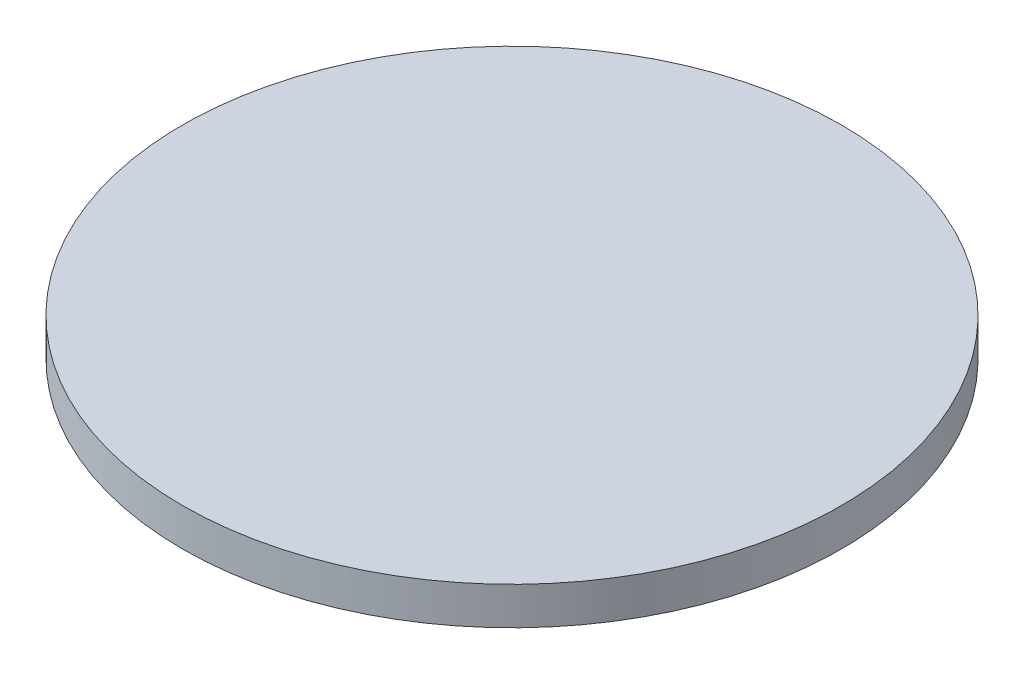
ISO-10303-21;
HEADER;
FILE_DESCRIPTION(('STEP AP214'),'2;1');
FILE_NAME('part.step','',(''),(''),'','','');
FILE_SCHEMA(('AUTOMOTIVE_DESIGN { 1 0 10303 214 1 1 1 1 }'));
ENDSEC;
DATA;
#1=APPLICATION_CONTEXT('core data for automotive mechanical design processes');
#2=APPLICATION_PROTOCOL_DEFINITION('international standard','automotive_design',2000,#1);
#3=PRODUCT_CONTEXT('',#1,'mechanical');
#4=PRODUCT('Part','Part','',(#3));
#5=PRODUCT_RELATED_PRODUCT_CATEGORY('part','',(#4));
#6=PRODUCT_DEFINITION_FORMATION('','',#4);
#7=PRODUCT_DEFINITION_CONTEXT('part definition',#1,'design');
#8=PRODUCT_DEFINITION('design','',#6,#7);
#9=PRODUCT_DEFINITION_SHAPE('','',#8);
#10=(LENGTH_UNIT() NAMED_UNIT(*) SI_UNIT(.MILLI.,.METRE.));
#11=(NAMED_UNIT(*) PLANE_ANGLE_UNIT() SI_UNIT($,.RADIAN.));
#12=(NAMED_UNIT(*) SI_UNIT($,.STERADIAN.) SOLID_ANGLE_UNIT());
#13=UNCERTAINTY_MEASURE_WITH_UNIT(LENGTH_MEASURE(1.E-05),#10,'distance_accuracy_value','');
#14=(GEOMETRIC_REPRESENTATION_CONTEXT(3) GLOBAL_UNCERTAINTY_ASSIGNED_CONTEXT((#13)) GLOBAL_UNIT_ASSIGNED_CONTEXT((#10,
#11,#12)) REPRESENTATION_CONTEXT('',''));
#15=CARTESIAN_POINT('',(0.,0.,0.));
#16=DIRECTION('',(0.,0.,1.));
#17=DIRECTION('',(1.,0.,0.));
#18=AXIS2_PLACEMENT_3D('',#15,#16,#17);
#19=CARTESIAN_POINT('',(0.,2.54,0.));
#20=DIRECTION('',(0.,-1.,0.));
#21=DIRECTION('',(0.,0.,-1.));
#22=AXIS2_PLACEMENT_3D('',#19,#20,#21);
#23=CYLINDRICAL_SURFACE('',#22,22.225);
#24=CARTESIAN_POINT('',(0.,2.54,0.));
#25=DIRECTION('',(0.,1.,0.));
#26=DIRECTION('',(0.,0.,1.));
#27=AXIS2_PLACEMENT_3D('',#24,#25,#26);
#28=CIRCLE('',#27,22.225);
#29=CARTESIAN_POINT('',(0.,2.54,22.225));
#30=VERTEX_POINT('',#29);
#31=EDGE_CURVE('E10',#30,#30,#28,.T.);
#32=ORIENTED_EDGE('',*,*,#31,.F.);
#33=EDGE_LOOP('',(#32));
#34=FACE_BOUND('',#33,.T.);
#35=CARTESIAN_POINT('',(0.,0.,0.));
#36=DIRECTION('',(0.,1.,0.));
#37=DIRECTION('',(0.,0.,1.));
#38=AXIS2_PLACEMENT_3D('',#35,#36,#37);
#39=CIRCLE('',#38,22.225);
#40=CARTESIAN_POINT('',(0.,0.,22.225));
#41=VERTEX_POINT('',#40);
#42=EDGE_CURVE('E34',#41,#41,#39,.T.);
#43=ORIENTED_EDGE('',*,*,#42,.T.);
#44=EDGE_LOOP('',(#43));
#45=FACE_BOUND('',#44,.T.);
#46=ADVANCED_FACE('F31',(#34,#45),#23,.T.);
#47=CARTESIAN_POINT('',(0.,2.54,0.));
#48=DIRECTION('',(0.,1.,0.));
#49=DIRECTION('',(0.,0.,1.));
#50=AXIS2_PLACEMENT_3D('',#47,#48,#49);
#51=PLANE('',#50);
#52=ORIENTED_EDGE('',*,*,#31,.T.);
#53=EDGE_LOOP('',(#52));
#54=FACE_BOUND('',#53,.T.);
#55=ADVANCED_FACE('F46',(#54),#51,.T.);
#56=CARTESIAN_POINT('',(0.,0.,0.));
#57=DIRECTION('',(0.,1.,0.));
#58=DIRECTION('',(0.,0.,1.));
#59=AXIS2_PLACEMENT_3D('',#56,#57,#58);
#60=PLANE('',#59);
#61=ORIENTED_EDGE('',*,*,#42,.F.);
#62=EDGE_LOOP('',(#61));
#63=FACE_BOUND('',#62,.T.);
#64=ADVANCED_FACE('F44',(#63),#60,.F.);
#65=CLOSED_SHELL('',(#46,#55,#64));
#66=MANIFOLD_SOLID_BREP('B2',#65);
#67=ADVANCED_BREP_SHAPE_REPRESENTATION('',(#18,#66),#14);
#68=SHAPE_DEFINITION_REPRESENTATION(#9,#67);
ENDSEC;
END-ISO-10303-21;
